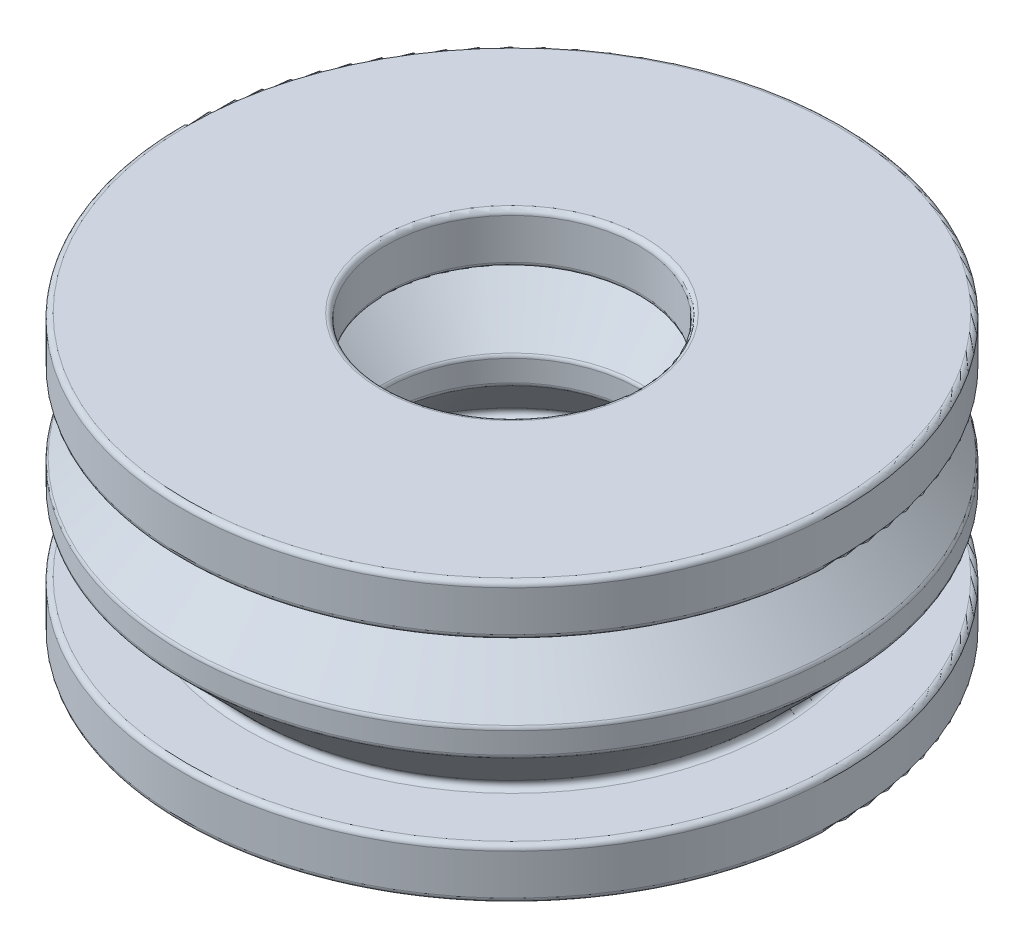
ISO-10303-21;
HEADER;
FILE_DESCRIPTION(('STEP AP214'),'2;1');
FILE_NAME('part.step','',(''),(''),'','','');
FILE_SCHEMA(('AUTOMOTIVE_DESIGN { 1 0 10303 214 1 1 1 1 }'));
ENDSEC;
DATA;
#1=APPLICATION_CONTEXT('core data for automotive mechanical design processes');
#2=APPLICATION_PROTOCOL_DEFINITION('international standard','automotive_design',2000,#1);
#3=PRODUCT_CONTEXT('',#1,'mechanical');
#4=PRODUCT('Part','Part','',(#3));
#5=PRODUCT_RELATED_PRODUCT_CATEGORY('part','',(#4));
#6=PRODUCT_DEFINITION_FORMATION('','',#4);
#7=PRODUCT_DEFINITION_CONTEXT('part definition',#1,'design');
#8=PRODUCT_DEFINITION('design','',#6,#7);
#9=PRODUCT_DEFINITION_SHAPE('','',#8);
#10=(LENGTH_UNIT() NAMED_UNIT(*) SI_UNIT(.MILLI.,.METRE.));
#11=(NAMED_UNIT(*) PLANE_ANGLE_UNIT() SI_UNIT($,.RADIAN.));
#12=(NAMED_UNIT(*) SI_UNIT($,.STERADIAN.) SOLID_ANGLE_UNIT());
#13=UNCERTAINTY_MEASURE_WITH_UNIT(LENGTH_MEASURE(1.E-05),#10,'distance_accuracy_value','');
#14=(GEOMETRIC_REPRESENTATION_CONTEXT(3) GLOBAL_UNCERTAINTY_ASSIGNED_CONTEXT((#13)) GLOBAL_UNIT_ASSIGNED_CONTEXT((#10,
#11,#12)) REPRESENTATION_CONTEXT('',''));
#15=CARTESIAN_POINT('',(0.,0.,0.));
#16=DIRECTION('',(0.,0.,1.));
#17=DIRECTION('',(1.,0.,0.));
#18=AXIS2_PLACEMENT_3D('',#15,#16,#17);
#19=CARTESIAN_POINT('',(0.,5.08284271247459,0.));
#20=DIRECTION('',(0.,-1.,0.));
#21=DIRECTION('',(0.,0.,-1.));
#22=AXIS2_PLACEMENT_3D('',#19,#20,#21);
#23=TOROIDAL_SURFACE('',#22,5.2,0.2);
#24=CARTESIAN_POINT('',(0.,5.08284271247459,0.));
#25=DIRECTION('',(0.,-1.,0.));
#26=DIRECTION('',(0.,0.,-1.));
#27=AXIS2_PLACEMENT_3D('',#24,#25,#26);
#28=CIRCLE('',#27,5.);
#29=CARTESIAN_POINT('',(0.,5.08284271247459,-5.));
#30=VERTEX_POINT('',#29);
#31=EDGE_CURVE('E10',#30,#30,#28,.T.);
#32=ORIENTED_EDGE('',*,*,#31,.F.);
#33=EDGE_LOOP('',(#32));
#34=FACE_BOUND('',#33,.T.);
#35=CARTESIAN_POINT('',(0.,4.94142135623727,0.));
#36=DIRECTION('',(0.,-1.,0.));
#37=DIRECTION('',(0.,0.,-1.));
#38=AXIS2_PLACEMENT_3D('',#35,#36,#37);
#39=CIRCLE('',#38,5.05857864376269);
#40=CARTESIAN_POINT('',(0.,4.94142135623727,-5.05857864376269));
#41=VERTEX_POINT('',#40);
#42=EDGE_CURVE('E134',#41,#41,#39,.T.);
#43=ORIENTED_EDGE('',*,*,#42,.T.);
#44=EDGE_LOOP('',(#43));
#45=FACE_BOUND('',#44,.T.);
#46=ADVANCED_FACE('F34',(#34,#45),#23,.T.);
#47=CARTESIAN_POINT('',(0.,0.,0.));
#48=DIRECTION('',(0.,-1.,0.));
#49=DIRECTION('',(0.,0.,-1.));
#50=AXIS2_PLACEMENT_3D('',#47,#48,#49);
#51=CYLINDRICAL_SURFACE('',#50,5.);
#52=CARTESIAN_POINT('',(0.,5.91715728752541,0.));
#53=DIRECTION('',(0.,-1.,0.));
#54=DIRECTION('',(0.,0.,-1.));
#55=AXIS2_PLACEMENT_3D('',#52,#53,#54);
#56=CIRCLE('',#55,5.);
#57=CARTESIAN_POINT('',(0.,5.91715728752541,-5.));
#58=VERTEX_POINT('',#57);
#59=EDGE_CURVE('E40',#58,#58,#56,.T.);
#60=ORIENTED_EDGE('',*,*,#59,.F.);
#61=EDGE_LOOP('',(#60));
#62=FACE_BOUND('',#61,.T.);
#63=ORIENTED_EDGE('',*,*,#31,.T.);
#64=EDGE_LOOP('',(#63));
#65=FACE_BOUND('',#64,.T.);
#66=ADVANCED_FACE('F315',(#62,#65),#51,.F.);
#67=CARTESIAN_POINT('',(0.,5.91715728752541,0.));
#68=DIRECTION('',(0.,-1.,0.));
#69=DIRECTION('',(0.,0.,-1.));
#70=AXIS2_PLACEMENT_3D('',#67,#68,#69);
#71=TOROIDAL_SURFACE('',#70,5.2,0.2);
#72=CARTESIAN_POINT('',(0.,6.05857864376272,0.));
#73=DIRECTION('',(0.,-1.,0.));
#74=DIRECTION('',(0.,0.,-1.));
#75=AXIS2_PLACEMENT_3D('',#72,#73,#74);
#76=CIRCLE('',#75,5.05857864376269);
#77=CARTESIAN_POINT('',(0.,6.05857864376272,-5.05857864376269));
#78=VERTEX_POINT('',#77);
#79=EDGE_CURVE('E44',#78,#78,#76,.T.);
#80=ORIENTED_EDGE('',*,*,#79,.F.);
#81=EDGE_LOOP('',(#80));
#82=FACE_BOUND('',#81,.T.);
#83=ORIENTED_EDGE('',*,*,#59,.T.);
#84=EDGE_LOOP('',(#83));
#85=FACE_BOUND('',#84,.T.);
#86=ADVANCED_FACE('F310',(#82,#85),#71,.T.);
#87=CARTESIAN_POINT('',(0.,6.05857864376272,0.));
#88=DIRECTION('',(0.,1.,0.));
#89=DIRECTION('',(0.,0.,1.));
#90=AXIS2_PLACEMENT_3D('',#87,#88,#89);
#91=CONICAL_SURFACE('',#90,5.05857864376269,0.785398163397454);
#92=CARTESIAN_POINT('',(0.,8.65857864376269,0.));
#93=DIRECTION('',(0.,-1.,0.));
#94=DIRECTION('',(0.,0.,-1.));
#95=AXIS2_PLACEMENT_3D('',#92,#93,#94);
#96=CIRCLE('',#95,7.65857864376268);
#97=CARTESIAN_POINT('',(0.,8.65857864376269,-7.65857864376268));
#98=VERTEX_POINT('',#97);
#99=EDGE_CURVE('E48',#98,#98,#96,.T.);
#100=ORIENTED_EDGE('',*,*,#99,.F.);
#101=EDGE_LOOP('',(#100));
#102=FACE_BOUND('',#101,.T.);
#103=ORIENTED_EDGE('',*,*,#79,.T.);
#104=EDGE_LOOP('',(#103));
#105=FACE_BOUND('',#104,.T.);
#106=ADVANCED_FACE('F304',(#102,#105),#91,.F.);
#107=CARTESIAN_POINT('',(0.,8.8,0.));
#108=DIRECTION('',(0.,-1.,0.));
#109=DIRECTION('',(0.,0.,-1.));
#110=AXIS2_PLACEMENT_3D('',#107,#108,#109);
#111=TOROIDAL_SURFACE('',#110,7.51715728752537,0.199999999999999);
#112=CARTESIAN_POINT('',(0.,9.,0.));
#113=DIRECTION('',(0.,-1.,0.));
#114=DIRECTION('',(0.,0.,-1.));
#115=AXIS2_PLACEMENT_3D('',#112,#113,#114);
#116=CIRCLE('',#115,7.51715728752537);
#117=CARTESIAN_POINT('',(0.,9.,-7.51715728752537));
#118=VERTEX_POINT('',#117);
#119=EDGE_CURVE('E53',#118,#118,#116,.T.);
#120=ORIENTED_EDGE('',*,*,#119,.F.);
#121=EDGE_LOOP('',(#120));
#122=FACE_BOUND('',#121,.T.);
#123=ORIENTED_EDGE('',*,*,#99,.T.);
#124=EDGE_LOOP('',(#123));
#125=FACE_BOUND('',#124,.T.);
#126=ADVANCED_FACE('F298',(#122,#125),#111,.F.);
#127=CARTESIAN_POINT('',(-5.2,9.,0.));
#128=DIRECTION('',(0.,1.,0.));
#129=DIRECTION('',(0.,0.,1.));
#130=AXIS2_PLACEMENT_3D('',#127,#128,#129);
#131=PLANE('',#130);
#132=CARTESIAN_POINT('',(0.,9.,0.));
#133=DIRECTION('',(0.,-1.,0.));
#134=DIRECTION('',(0.,0.,-1.));
#135=AXIS2_PLACEMENT_3D('',#132,#133,#134);
#136=CIRCLE('',#135,5.2);
#137=CARTESIAN_POINT('',(0.,9.,-5.2));
#138=VERTEX_POINT('',#137);
#139=EDGE_CURVE('E56',#138,#138,#136,.T.);
#140=ORIENTED_EDGE('',*,*,#139,.F.);
#141=EDGE_LOOP('',(#140));
#142=FACE_BOUND('',#141,.T.);
#143=ORIENTED_EDGE('',*,*,#119,.T.);
#144=EDGE_LOOP('',(#143));
#145=FACE_BOUND('',#144,.T.);
#146=ADVANCED_FACE('F292',(#142,#145),#131,.F.);
#147=CARTESIAN_POINT('',(0.,9.2,0.));
#148=DIRECTION('',(0.,-1.,0.));
#149=DIRECTION('',(0.,0.,-1.));
#150=AXIS2_PLACEMENT_3D('',#147,#148,#149);
#151=TOROIDAL_SURFACE('',#150,5.2,0.2);
#152=CARTESIAN_POINT('',(0.,9.2,0.));
#153=DIRECTION('',(0.,-1.,0.));
#154=DIRECTION('',(0.,0.,-1.));
#155=AXIS2_PLACEMENT_3D('',#152,#153,#154);
#156=CIRCLE('',#155,5.);
#157=CARTESIAN_POINT('',(0.,9.2,-5.));
#158=VERTEX_POINT('',#157);
#159=EDGE_CURVE('E59',#158,#158,#156,.T.);
#160=ORIENTED_EDGE('',*,*,#159,.F.);
#161=EDGE_LOOP('',(#160));
#162=FACE_BOUND('',#161,.T.);
#163=ORIENTED_EDGE('',*,*,#139,.T.);
#164=EDGE_LOOP('',(#163));
#165=FACE_BOUND('',#164,.T.);
#166=ADVANCED_FACE('F286',(#162,#165),#151,.T.);
#167=CARTESIAN_POINT('',(0.,0.,0.));
#168=DIRECTION('',(0.,-1.,0.));
#169=DIRECTION('',(0.,0.,-1.));
#170=AXIS2_PLACEMENT_3D('',#167,#168,#169);
#171=CYLINDRICAL_SURFACE('',#170,5.);
#172=CARTESIAN_POINT('',(0.,10.8,0.));
#173=DIRECTION('',(0.,-1.,0.));
#174=DIRECTION('',(0.,0.,-1.));
#175=AXIS2_PLACEMENT_3D('',#172,#173,#174);
#176=CIRCLE('',#175,4.99999999999999);
#177=CARTESIAN_POINT('',(0.,10.8,-4.99999999999999));
#178=VERTEX_POINT('',#177);
#179=EDGE_CURVE('E62',#178,#178,#176,.T.);
#180=ORIENTED_EDGE('',*,*,#179,.F.);
#181=EDGE_LOOP('',(#180));
#182=FACE_BOUND('',#181,.T.);
#183=ORIENTED_EDGE('',*,*,#159,.T.);
#184=EDGE_LOOP('',(#183));
#185=FACE_BOUND('',#184,.T.);
#186=ADVANCED_FACE('F280',(#182,#185),#171,.F.);
#187=CARTESIAN_POINT('',(0.,10.8,0.));
#188=DIRECTION('',(0.,-1.,0.));
#189=DIRECTION('',(0.,0.,-1.));
#190=AXIS2_PLACEMENT_3D('',#187,#188,#189);
#191=TOROIDAL_SURFACE('',#190,5.2,0.200000000000001);
#192=CARTESIAN_POINT('',(0.,11.,0.));
#193=DIRECTION('',(0.,-1.,0.));
#194=DIRECTION('',(0.,0.,-1.));
#195=AXIS2_PLACEMENT_3D('',#192,#193,#194);
#196=CIRCLE('',#195,5.2);
#197=CARTESIAN_POINT('',(0.,11.,-5.2));
#198=VERTEX_POINT('',#197);
#199=EDGE_CURVE('E65',#198,#198,#196,.T.);
#200=ORIENTED_EDGE('',*,*,#199,.F.);
#201=EDGE_LOOP('',(#200));
#202=FACE_BOUND('',#201,.T.);
#203=ORIENTED_EDGE('',*,*,#179,.T.);
#204=EDGE_LOOP('',(#203));
#205=FACE_BOUND('',#204,.T.);
#206=ADVANCED_FACE('F274',(#202,#205),#191,.T.);
#207=CARTESIAN_POINT('',(-5.2,11.,0.));
#208=DIRECTION('',(0.,-1.,0.));
#209=DIRECTION('',(0.,0.,-1.));
#210=AXIS2_PLACEMENT_3D('',#207,#208,#209);
#211=PLANE('',#210);
#212=CARTESIAN_POINT('',(0.,11.,0.));
#213=DIRECTION('',(0.,-1.,0.));
#214=DIRECTION('',(0.,0.,-1.));
#215=AXIS2_PLACEMENT_3D('',#212,#213,#214);
#216=CIRCLE('',#215,12.8);
#217=CARTESIAN_POINT('',(0.,11.,-12.8));
#218=VERTEX_POINT('',#217);
#219=EDGE_CURVE('E68',#218,#218,#216,.T.);
#220=ORIENTED_EDGE('',*,*,#219,.F.);
#221=EDGE_LOOP('',(#220));
#222=FACE_BOUND('',#221,.T.);
#223=ORIENTED_EDGE('',*,*,#199,.T.);
#224=EDGE_LOOP('',(#223));
#225=FACE_BOUND('',#224,.T.);
#226=ADVANCED_FACE('F268',(#222,#225),#211,.F.);
#227=CARTESIAN_POINT('',(0.,10.8,0.));
#228=DIRECTION('',(0.,-1.,0.));
#229=DIRECTION('',(0.,0.,-1.));
#230=AXIS2_PLACEMENT_3D('',#227,#228,#229);
#231=TOROIDAL_SURFACE('',#230,12.8,0.2);
#232=CARTESIAN_POINT('',(0.,10.8,0.));
#233=DIRECTION('',(0.,-1.,0.));
#234=DIRECTION('',(0.,0.,-1.));
#235=AXIS2_PLACEMENT_3D('',#232,#233,#234);
#236=CIRCLE('',#235,13.);
#237=CARTESIAN_POINT('',(0.,10.8,-13.));
#238=VERTEX_POINT('',#237);
#239=EDGE_CURVE('E71',#238,#238,#236,.T.);
#240=ORIENTED_EDGE('',*,*,#239,.F.);
#241=EDGE_LOOP('',(#240));
#242=FACE_BOUND('',#241,.T.);
#243=ORIENTED_EDGE('',*,*,#219,.T.);
#244=EDGE_LOOP('',(#243));
#245=FACE_BOUND('',#244,.T.);
#246=ADVANCED_FACE('F262',(#242,#245),#231,.T.);
#247=CARTESIAN_POINT('',(0.,0.,0.));
#248=DIRECTION('',(0.,-1.,0.));
#249=DIRECTION('',(0.,0.,-1.));
#250=AXIS2_PLACEMENT_3D('',#247,#248,#249);
#251=CYLINDRICAL_SURFACE('',#250,13.);
#252=CARTESIAN_POINT('',(0.,9.2,0.));
#253=DIRECTION('',(0.,-1.,0.));
#254=DIRECTION('',(0.,0.,-1.));
#255=AXIS2_PLACEMENT_3D('',#252,#253,#254);
#256=CIRCLE('',#255,13.);
#257=CARTESIAN_POINT('',(0.,9.2,-13.));
#258=VERTEX_POINT('',#257);
#259=EDGE_CURVE('E74',#258,#258,#256,.T.);
#260=ORIENTED_EDGE('',*,*,#259,.F.);
#261=EDGE_LOOP('',(#260));
#262=FACE_BOUND('',#261,.T.);
#263=ORIENTED_EDGE('',*,*,#239,.T.);
#264=EDGE_LOOP('',(#263));
#265=FACE_BOUND('',#264,.T.);
#266=ADVANCED_FACE('F256',(#262,#265),#251,.T.);
#267=CARTESIAN_POINT('',(0.,9.2,0.));
#268=DIRECTION('',(0.,-1.,0.));
#269=DIRECTION('',(0.,0.,-1.));
#270=AXIS2_PLACEMENT_3D('',#267,#268,#269);
#271=TOROIDAL_SURFACE('',#270,12.8,0.200000000000001);
#272=CARTESIAN_POINT('',(0.,9.,0.));
#273=DIRECTION('',(0.,-1.,0.));
#274=DIRECTION('',(0.,0.,-1.));
#275=AXIS2_PLACEMENT_3D('',#272,#273,#274);
#276=CIRCLE('',#275,12.8);
#277=CARTESIAN_POINT('',(0.,9.,-12.8));
#278=VERTEX_POINT('',#277);
#279=EDGE_CURVE('E77',#278,#278,#276,.T.);
#280=ORIENTED_EDGE('',*,*,#279,.F.);
#281=EDGE_LOOP('',(#280));
#282=FACE_BOUND('',#281,.T.);
#283=ORIENTED_EDGE('',*,*,#259,.T.);
#284=EDGE_LOOP('',(#283));
#285=FACE_BOUND('',#284,.T.);
#286=ADVANCED_FACE('F250',(#282,#285),#271,.T.);
#287=CARTESIAN_POINT('',(-12.8,9.,0.));
#288=DIRECTION('',(0.,1.,0.));
#289=DIRECTION('',(0.,0.,1.));
#290=AXIS2_PLACEMENT_3D('',#287,#288,#289);
#291=PLANE('',#290);
#292=CARTESIAN_POINT('',(0.,9.,0.));
#293=DIRECTION('',(0.,-1.,0.));
#294=DIRECTION('',(0.,0.,-1.));
#295=AXIS2_PLACEMENT_3D('',#292,#293,#294);
#296=CIRCLE('',#295,10.4828427124746);
#297=CARTESIAN_POINT('',(0.,9.,-10.4828427124746));
#298=VERTEX_POINT('',#297);
#299=EDGE_CURVE('E80',#298,#298,#296,.T.);
#300=ORIENTED_EDGE('',*,*,#299,.F.);
#301=EDGE_LOOP('',(#300));
#302=FACE_BOUND('',#301,.T.);
#303=ORIENTED_EDGE('',*,*,#279,.T.);
#304=EDGE_LOOP('',(#303));
#305=FACE_BOUND('',#304,.T.);
#306=ADVANCED_FACE('F244',(#302,#305),#291,.F.);
#307=CARTESIAN_POINT('',(0.,8.8,0.));
#308=DIRECTION('',(0.,-1.,0.));
#309=DIRECTION('',(0.,0.,-1.));
#310=AXIS2_PLACEMENT_3D('',#307,#308,#309);
#311=TOROIDAL_SURFACE('',#310,10.4828427124746,0.200000000000001);
#312=CARTESIAN_POINT('',(0.,8.65857864376269,0.));
#313=DIRECTION('',(0.,-1.,0.));
#314=DIRECTION('',(0.,0.,-1.));
#315=AXIS2_PLACEMENT_3D('',#312,#313,#314);
#316=CIRCLE('',#315,10.3414213562373);
#317=CARTESIAN_POINT('',(0.,8.65857864376269,-10.3414213562373));
#318=VERTEX_POINT('',#317);
#319=EDGE_CURVE('E83',#318,#318,#316,.T.);
#320=ORIENTED_EDGE('',*,*,#319,.F.);
#321=EDGE_LOOP('',(#320));
#322=FACE_BOUND('',#321,.T.);
#323=ORIENTED_EDGE('',*,*,#299,.T.);
#324=EDGE_LOOP('',(#323));
#325=FACE_BOUND('',#324,.T.);
#326=ADVANCED_FACE('F238',(#322,#325),#311,.F.);
#327=CARTESIAN_POINT('',(0.,8.65857864376269,0.));
#328=DIRECTION('',(0.,-1.,0.));
#329=DIRECTION('',(0.,0.,-1.));
#330=AXIS2_PLACEMENT_3D('',#327,#328,#329);
#331=CONICAL_SURFACE('',#330,10.3414213562373,0.785398163397453);
#332=CARTESIAN_POINT('',(0.,6.05857864376272,0.));
#333=DIRECTION('',(0.,-1.,0.));
#334=DIRECTION('',(0.,0.,-1.));
#335=AXIS2_PLACEMENT_3D('',#332,#333,#334);
#336=CIRCLE('',#335,12.9414213562373);
#337=CARTESIAN_POINT('',(0.,6.05857864376272,-12.9414213562373));
#338=VERTEX_POINT('',#337);
#339=EDGE_CURVE('E86',#338,#338,#336,.T.);
#340=ORIENTED_EDGE('',*,*,#339,.F.);
#341=EDGE_LOOP('',(#340));
#342=FACE_BOUND('',#341,.T.);
#343=ORIENTED_EDGE('',*,*,#319,.T.);
#344=EDGE_LOOP('',(#343));
#345=FACE_BOUND('',#344,.T.);
#346=ADVANCED_FACE('F232',(#342,#345),#331,.T.);
#347=CARTESIAN_POINT('',(0.,5.91715728752542,0.));
#348=DIRECTION('',(0.,-1.,0.));
#349=DIRECTION('',(0.,0.,-1.));
#350=AXIS2_PLACEMENT_3D('',#347,#348,#349);
#351=TOROIDAL_SURFACE('',#350,12.8,0.199999999999999);
#352=CARTESIAN_POINT('',(0.,5.91715728752542,0.));
#353=DIRECTION('',(0.,-1.,0.));
#354=DIRECTION('',(0.,0.,-1.));
#355=AXIS2_PLACEMENT_3D('',#352,#353,#354);
#356=CIRCLE('',#355,13.);
#357=CARTESIAN_POINT('',(0.,5.91715728752542,-13.));
#358=VERTEX_POINT('',#357);
#359=EDGE_CURVE('E89',#358,#358,#356,.T.);
#360=ORIENTED_EDGE('',*,*,#359,.F.);
#361=EDGE_LOOP('',(#360));
#362=FACE_BOUND('',#361,.T.);
#363=ORIENTED_EDGE('',*,*,#339,.T.);
#364=EDGE_LOOP('',(#363));
#365=FACE_BOUND('',#364,.T.);
#366=ADVANCED_FACE('F226',(#362,#365),#351,.T.);
#367=CARTESIAN_POINT('',(0.,0.,0.));
#368=DIRECTION('',(0.,-1.,0.));
#369=DIRECTION('',(0.,0.,-1.));
#370=AXIS2_PLACEMENT_3D('',#367,#368,#369);
#371=CYLINDRICAL_SURFACE('',#370,13.);
#372=CARTESIAN_POINT('',(0.,5.08284271247458,0.));
#373=DIRECTION('',(0.,-1.,0.));
#374=DIRECTION('',(0.,0.,-1.));
#375=AXIS2_PLACEMENT_3D('',#372,#373,#374);
#376=CIRCLE('',#375,13.);
#377=CARTESIAN_POINT('',(0.,5.08284271247458,-13.));
#378=VERTEX_POINT('',#377);
#379=EDGE_CURVE('E92',#378,#378,#376,.T.);
#380=ORIENTED_EDGE('',*,*,#379,.F.);
#381=EDGE_LOOP('',(#380));
#382=FACE_BOUND('',#381,.T.);
#383=ORIENTED_EDGE('',*,*,#359,.T.);
#384=EDGE_LOOP('',(#383));
#385=FACE_BOUND('',#384,.T.);
#386=ADVANCED_FACE('F220',(#382,#385),#371,.T.);
#387=CARTESIAN_POINT('',(0.,5.08284271247458,0.));
#388=DIRECTION('',(0.,-1.,0.));
#389=DIRECTION('',(0.,0.,-1.));
#390=AXIS2_PLACEMENT_3D('',#387,#388,#389);
#391=TOROIDAL_SURFACE('',#390,12.8,0.199999999999998);
#392=CARTESIAN_POINT('',(0.,4.94142135623727,0.));
#393=DIRECTION('',(0.,-1.,0.));
#394=DIRECTION('',(0.,0.,-1.));
#395=AXIS2_PLACEMENT_3D('',#392,#393,#394);
#396=CIRCLE('',#395,12.9414213562373);
#397=CARTESIAN_POINT('',(0.,4.94142135623727,-12.9414213562373));
#398=VERTEX_POINT('',#397);
#399=EDGE_CURVE('E95',#398,#398,#396,.T.);
#400=ORIENTED_EDGE('',*,*,#399,.F.);
#401=EDGE_LOOP('',(#400));
#402=FACE_BOUND('',#401,.T.);
#403=ORIENTED_EDGE('',*,*,#379,.T.);
#404=EDGE_LOOP('',(#403));
#405=FACE_BOUND('',#404,.T.);
#406=ADVANCED_FACE('F214',(#402,#405),#391,.T.);
#407=CARTESIAN_POINT('',(0.,4.94142135623727,0.));
#408=DIRECTION('',(0.,1.,0.));
#409=DIRECTION('',(0.,0.,1.));
#410=AXIS2_PLACEMENT_3D('',#407,#408,#409);
#411=CONICAL_SURFACE('',#410,12.9414213562373,0.785398163397454);
#412=CARTESIAN_POINT('',(0.,2.34142135623731,0.));
#413=DIRECTION('',(0.,-1.,0.));
#414=DIRECTION('',(0.,0.,-1.));
#415=AXIS2_PLACEMENT_3D('',#412,#413,#414);
#416=CIRCLE('',#415,10.3414213562373);
#417=CARTESIAN_POINT('',(0.,2.34142135623731,-10.3414213562373));
#418=VERTEX_POINT('',#417);
#419=EDGE_CURVE('E98',#418,#418,#416,.T.);
#420=ORIENTED_EDGE('',*,*,#419,.F.);
#421=EDGE_LOOP('',(#420));
#422=FACE_BOUND('',#421,.T.);
#423=ORIENTED_EDGE('',*,*,#399,.T.);
#424=EDGE_LOOP('',(#423));
#425=FACE_BOUND('',#424,.T.);
#426=ADVANCED_FACE('F208',(#422,#425),#411,.T.);
#427=CARTESIAN_POINT('',(0.,2.2,0.));
#428=DIRECTION('',(0.,-1.,0.));
#429=DIRECTION('',(0.,0.,-1.));
#430=AXIS2_PLACEMENT_3D('',#427,#428,#429);
#431=TOROIDAL_SURFACE('',#430,10.4828427124746,0.2);
#432=CARTESIAN_POINT('',(0.,2.,0.));
#433=DIRECTION('',(0.,-1.,0.));
#434=DIRECTION('',(0.,0.,-1.));
#435=AXIS2_PLACEMENT_3D('',#432,#433,#434);
#436=CIRCLE('',#435,10.4828427124746);
#437=CARTESIAN_POINT('',(0.,2.,-10.4828427124746));
#438=VERTEX_POINT('',#437);
#439=EDGE_CURVE('E101',#438,#438,#436,.T.);
#440=ORIENTED_EDGE('',*,*,#439,.F.);
#441=EDGE_LOOP('',(#440));
#442=FACE_BOUND('',#441,.T.);
#443=ORIENTED_EDGE('',*,*,#419,.T.);
#444=EDGE_LOOP('',(#443));
#445=FACE_BOUND('',#444,.T.);
#446=ADVANCED_FACE('F202',(#442,#445),#431,.F.);
#447=CARTESIAN_POINT('',(-10.4828427124746,2.,0.));
#448=DIRECTION('',(0.,-1.,0.));
#449=DIRECTION('',(0.,0.,-1.));
#450=AXIS2_PLACEMENT_3D('',#447,#448,#449);
#451=PLANE('',#450);
#452=CARTESIAN_POINT('',(0.,2.,0.));
#453=DIRECTION('',(0.,-1.,0.));
#454=DIRECTION('',(0.,0.,-1.));
#455=AXIS2_PLACEMENT_3D('',#452,#453,#454);
#456=CIRCLE('',#455,12.8);
#457=CARTESIAN_POINT('',(0.,2.,-12.8));
#458=VERTEX_POINT('',#457);
#459=EDGE_CURVE('E104',#458,#458,#456,.T.);
#460=ORIENTED_EDGE('',*,*,#459,.F.);
#461=EDGE_LOOP('',(#460));
#462=FACE_BOUND('',#461,.T.);
#463=ORIENTED_EDGE('',*,*,#439,.T.);
#464=EDGE_LOOP('',(#463));
#465=FACE_BOUND('',#464,.T.);
#466=ADVANCED_FACE('F196',(#462,#465),#451,.F.);
#467=CARTESIAN_POINT('',(0.,1.8,0.));
#468=DIRECTION('',(0.,-1.,0.));
#469=DIRECTION('',(0.,0.,-1.));
#470=AXIS2_PLACEMENT_3D('',#467,#468,#469);
#471=TOROIDAL_SURFACE('',#470,12.8,0.200000000000001);
#472=CARTESIAN_POINT('',(0.,1.8,0.));
#473=DIRECTION('',(0.,-1.,0.));
#474=DIRECTION('',(0.,0.,-1.));
#475=AXIS2_PLACEMENT_3D('',#472,#473,#474);
#476=CIRCLE('',#475,13.);
#477=CARTESIAN_POINT('',(0.,1.8,-13.));
#478=VERTEX_POINT('',#477);
#479=EDGE_CURVE('E107',#478,#478,#476,.T.);
#480=ORIENTED_EDGE('',*,*,#479,.F.);
#481=EDGE_LOOP('',(#480));
#482=FACE_BOUND('',#481,.T.);
#483=ORIENTED_EDGE('',*,*,#459,.T.);
#484=EDGE_LOOP('',(#483));
#485=FACE_BOUND('',#484,.T.);
#486=ADVANCED_FACE('F190',(#482,#485),#471,.T.);
#487=CARTESIAN_POINT('',(0.,0.,0.));
#488=DIRECTION('',(0.,-1.,0.));
#489=DIRECTION('',(0.,0.,-1.));
#490=AXIS2_PLACEMENT_3D('',#487,#488,#489);
#491=CYLINDRICAL_SURFACE('',#490,13.);
#492=CARTESIAN_POINT('',(0.,0.2,0.));
#493=DIRECTION('',(0.,-1.,0.));
#494=DIRECTION('',(0.,0.,-1.));
#495=AXIS2_PLACEMENT_3D('',#492,#493,#494);
#496=CIRCLE('',#495,13.);
#497=CARTESIAN_POINT('',(0.,0.2,-13.));
#498=VERTEX_POINT('',#497);
#499=EDGE_CURVE('E110',#498,#498,#496,.T.);
#500=ORIENTED_EDGE('',*,*,#499,.F.);
#501=EDGE_LOOP('',(#500));
#502=FACE_BOUND('',#501,.T.);
#503=ORIENTED_EDGE('',*,*,#479,.T.);
#504=EDGE_LOOP('',(#503));
#505=FACE_BOUND('',#504,.T.);
#506=ADVANCED_FACE('F184',(#502,#505),#491,.T.);
#507=CARTESIAN_POINT('',(0.,0.2,0.));
#508=DIRECTION('',(0.,-1.,0.));
#509=DIRECTION('',(0.,0.,-1.));
#510=AXIS2_PLACEMENT_3D('',#507,#508,#509);
#511=TOROIDAL_SURFACE('',#510,12.8,0.2);
#512=CARTESIAN_POINT('',(0.,0.,0.));
#513=DIRECTION('',(0.,-1.,0.));
#514=DIRECTION('',(0.,0.,-1.));
#515=AXIS2_PLACEMENT_3D('',#512,#513,#514);
#516=CIRCLE('',#515,12.8);
#517=CARTESIAN_POINT('',(0.,0.,-12.8));
#518=VERTEX_POINT('',#517);
#519=EDGE_CURVE('E113',#518,#518,#516,.T.);
#520=ORIENTED_EDGE('',*,*,#519,.F.);
#521=EDGE_LOOP('',(#520));
#522=FACE_BOUND('',#521,.T.);
#523=ORIENTED_EDGE('',*,*,#499,.T.);
#524=EDGE_LOOP('',(#523));
#525=FACE_BOUND('',#524,.T.);
#526=ADVANCED_FACE('F178',(#522,#525),#511,.T.);
#527=CARTESIAN_POINT('',(-12.8,0.,0.));
#528=DIRECTION('',(0.,1.,0.));
#529=DIRECTION('',(0.,0.,1.));
#530=AXIS2_PLACEMENT_3D('',#527,#528,#529);
#531=PLANE('',#530);
#532=CARTESIAN_POINT('',(0.,0.,0.));
#533=DIRECTION('',(0.,-1.,0.));
#534=DIRECTION('',(0.,0.,-1.));
#535=AXIS2_PLACEMENT_3D('',#532,#533,#534);
#536=CIRCLE('',#535,5.2);
#537=CARTESIAN_POINT('',(0.,0.,-5.2));
#538=VERTEX_POINT('',#537);
#539=EDGE_CURVE('E116',#538,#538,#536,.T.);
#540=ORIENTED_EDGE('',*,*,#539,.F.);
#541=EDGE_LOOP('',(#540));
#542=FACE_BOUND('',#541,.T.);
#543=ORIENTED_EDGE('',*,*,#519,.T.);
#544=EDGE_LOOP('',(#543));
#545=FACE_BOUND('',#544,.T.);
#546=ADVANCED_FACE('F172',(#542,#545),#531,.F.);
#547=CARTESIAN_POINT('',(0.,0.2,0.));
#548=DIRECTION('',(0.,-1.,0.));
#549=DIRECTION('',(0.,0.,-1.));
#550=AXIS2_PLACEMENT_3D('',#547,#548,#549);
#551=TOROIDAL_SURFACE('',#550,5.2,0.2);
#552=CARTESIAN_POINT('',(0.,0.2,0.));
#553=DIRECTION('',(0.,-1.,0.));
#554=DIRECTION('',(0.,0.,-1.));
#555=AXIS2_PLACEMENT_3D('',#552,#553,#554);
#556=CIRCLE('',#555,5.);
#557=CARTESIAN_POINT('',(0.,0.2,-5.));
#558=VERTEX_POINT('',#557);
#559=EDGE_CURVE('E119',#558,#558,#556,.T.);
#560=ORIENTED_EDGE('',*,*,#559,.F.);
#561=EDGE_LOOP('',(#560));
#562=FACE_BOUND('',#561,.T.);
#563=ORIENTED_EDGE('',*,*,#539,.T.);
#564=EDGE_LOOP('',(#563));
#565=FACE_BOUND('',#564,.T.);
#566=ADVANCED_FACE('F166',(#562,#565),#551,.T.);
#567=CARTESIAN_POINT('',(0.,0.,0.));
#568=DIRECTION('',(0.,-1.,0.));
#569=DIRECTION('',(0.,0.,-1.));
#570=AXIS2_PLACEMENT_3D('',#567,#568,#569);
#571=CYLINDRICAL_SURFACE('',#570,5.);
#572=CARTESIAN_POINT('',(0.,1.8,0.));
#573=DIRECTION('',(0.,-1.,0.));
#574=DIRECTION('',(0.,0.,-1.));
#575=AXIS2_PLACEMENT_3D('',#572,#573,#574);
#576=CIRCLE('',#575,5.);
#577=CARTESIAN_POINT('',(0.,1.8,-5.));
#578=VERTEX_POINT('',#577);
#579=EDGE_CURVE('E122',#578,#578,#576,.T.);
#580=ORIENTED_EDGE('',*,*,#579,.F.);
#581=EDGE_LOOP('',(#580));
#582=FACE_BOUND('',#581,.T.);
#583=ORIENTED_EDGE('',*,*,#559,.T.);
#584=EDGE_LOOP('',(#583));
#585=FACE_BOUND('',#584,.T.);
#586=ADVANCED_FACE('F160',(#582,#585),#571,.F.);
#587=CARTESIAN_POINT('',(0.,1.8,0.));
#588=DIRECTION('',(0.,-1.,0.));
#589=DIRECTION('',(0.,0.,-1.));
#590=AXIS2_PLACEMENT_3D('',#587,#588,#589);
#591=TOROIDAL_SURFACE('',#590,5.2,0.2);
#592=CARTESIAN_POINT('',(0.,2.,0.));
#593=DIRECTION('',(0.,-1.,0.));
#594=DIRECTION('',(0.,0.,-1.));
#595=AXIS2_PLACEMENT_3D('',#592,#593,#594);
#596=CIRCLE('',#595,5.2);
#597=CARTESIAN_POINT('',(0.,2.,-5.2));
#598=VERTEX_POINT('',#597);
#599=EDGE_CURVE('E125',#598,#598,#596,.T.);
#600=ORIENTED_EDGE('',*,*,#599,.F.);
#601=EDGE_LOOP('',(#600));
#602=FACE_BOUND('',#601,.T.);
#603=ORIENTED_EDGE('',*,*,#579,.T.);
#604=EDGE_LOOP('',(#603));
#605=FACE_BOUND('',#604,.T.);
#606=ADVANCED_FACE('F154',(#602,#605),#591,.T.);
#607=CARTESIAN_POINT('',(-5.2,2.,0.));
#608=DIRECTION('',(0.,-1.,0.));
#609=DIRECTION('',(0.,0.,-1.));
#610=AXIS2_PLACEMENT_3D('',#607,#608,#609);
#611=PLANE('',#610);
#612=CARTESIAN_POINT('',(0.,2.,0.));
#613=DIRECTION('',(0.,-1.,0.));
#614=DIRECTION('',(0.,0.,-1.));
#615=AXIS2_PLACEMENT_3D('',#612,#613,#614);
#616=CIRCLE('',#615,7.51715728752538);
#617=CARTESIAN_POINT('',(0.,2.,-7.51715728752538));
#618=VERTEX_POINT('',#617);
#619=EDGE_CURVE('E128',#618,#618,#616,.T.);
#620=ORIENTED_EDGE('',*,*,#619,.F.);
#621=EDGE_LOOP('',(#620));
#622=FACE_BOUND('',#621,.T.);
#623=ORIENTED_EDGE('',*,*,#599,.T.);
#624=EDGE_LOOP('',(#623));
#625=FACE_BOUND('',#624,.T.);
#626=ADVANCED_FACE('F148',(#622,#625),#611,.F.);
#627=CARTESIAN_POINT('',(0.,2.2,0.));
#628=DIRECTION('',(0.,-1.,0.));
#629=DIRECTION('',(0.,0.,-1.));
#630=AXIS2_PLACEMENT_3D('',#627,#628,#629);
#631=TOROIDAL_SURFACE('',#630,7.51715728752538,0.2);
#632=CARTESIAN_POINT('',(0.,2.34142135623731,0.));
#633=DIRECTION('',(0.,-1.,0.));
#634=DIRECTION('',(0.,0.,-1.));
#635=AXIS2_PLACEMENT_3D('',#632,#633,#634);
#636=CIRCLE('',#635,7.65857864376268);
#637=CARTESIAN_POINT('',(0.,2.34142135623731,-7.65857864376268));
#638=VERTEX_POINT('',#637);
#639=EDGE_CURVE('E131',#638,#638,#636,.T.);
#640=ORIENTED_EDGE('',*,*,#639,.F.);
#641=EDGE_LOOP('',(#640));
#642=FACE_BOUND('',#641,.T.);
#643=ORIENTED_EDGE('',*,*,#619,.T.);
#644=EDGE_LOOP('',(#643));
#645=FACE_BOUND('',#644,.T.);
#646=ADVANCED_FACE('F142',(#642,#645),#631,.F.);
#647=CARTESIAN_POINT('',(0.,2.34142135623731,0.));
#648=DIRECTION('',(0.,-1.,0.));
#649=DIRECTION('',(0.,0.,-1.));
#650=AXIS2_PLACEMENT_3D('',#647,#648,#649);
#651=CONICAL_SURFACE('',#650,7.65857864376268,0.785398163397454);
#652=ORIENTED_EDGE('',*,*,#42,.F.);
#653=EDGE_LOOP('',(#652));
#654=FACE_BOUND('',#653,.T.);
#655=ORIENTED_EDGE('',*,*,#639,.T.);
#656=EDGE_LOOP('',(#655));
#657=FACE_BOUND('',#656,.T.);
#658=ADVANCED_FACE('F139',(#654,#657),#651,.F.);
#659=CLOSED_SHELL('',(#46,#66,#86,#106,#126,#146,#166,#186,#206,#226,#246,#266,#286,#306,#326,
#346,#366,#386,#406,#426,#446,#466,#486,#506,#526,#546,#566,#586,#606,#626,#646,#658));
#660=MANIFOLD_SOLID_BREP('B2',#659);
#661=ADVANCED_BREP_SHAPE_REPRESENTATION('',(#18,#660),#14);
#662=SHAPE_DEFINITION_REPRESENTATION(#9,#661);
ENDSEC;
END-ISO-10303-21;
